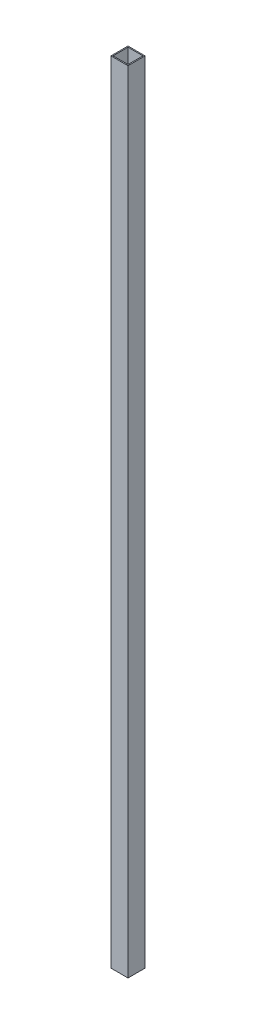
ISO-10303-21;
HEADER;
FILE_DESCRIPTION(('STEP AP214'),'2;1');
FILE_NAME('part.step','',(''),(''),'','','');
FILE_SCHEMA(('AUTOMOTIVE_DESIGN { 1 0 10303 214 1 1 1 1 }'));
ENDSEC;
DATA;
#1=APPLICATION_CONTEXT('core data for automotive mechanical design processes');
#2=APPLICATION_PROTOCOL_DEFINITION('international standard','automotive_design',2000,#1);
#3=PRODUCT_CONTEXT('',#1,'mechanical');
#4=PRODUCT('Part','Part','',(#3));
#5=PRODUCT_RELATED_PRODUCT_CATEGORY('part','',(#4));
#6=PRODUCT_DEFINITION_FORMATION('','',#4);
#7=PRODUCT_DEFINITION_CONTEXT('part definition',#1,'design');
#8=PRODUCT_DEFINITION('design','',#6,#7);
#9=PRODUCT_DEFINITION_SHAPE('','',#8);
#10=(LENGTH_UNIT() NAMED_UNIT(*) SI_UNIT(.MILLI.,.METRE.));
#11=(NAMED_UNIT(*) PLANE_ANGLE_UNIT() SI_UNIT($,.RADIAN.));
#12=(NAMED_UNIT(*) SI_UNIT($,.STERADIAN.) SOLID_ANGLE_UNIT());
#13=UNCERTAINTY_MEASURE_WITH_UNIT(LENGTH_MEASURE(1.E-05),#10,'distance_accuracy_value','');
#14=(GEOMETRIC_REPRESENTATION_CONTEXT(3) GLOBAL_UNCERTAINTY_ASSIGNED_CONTEXT((#13)) GLOBAL_UNIT_ASSIGNED_CONTEXT((#10,
#11,#12)) REPRESENTATION_CONTEXT('',''));
#15=CARTESIAN_POINT('',(0.,0.,0.));
#16=DIRECTION('',(0.,0.,1.));
#17=DIRECTION('',(1.,0.,0.));
#18=AXIS2_PLACEMENT_3D('',#15,#16,#17);
#19=CARTESIAN_POINT('',(0.,370.,0.));
#20=DIRECTION('',(0.,-1.,0.));
#21=DIRECTION('',(0.,0.,-1.));
#22=AXIS2_PLACEMENT_3D('',#19,#20,#21);
#23=PLANE('',#22);
#24=DIRECTION('',(0.,0.,1.));
#25=VECTOR('',#24,1.);
#26=CARTESIAN_POINT('',(0.,370.,0.));
#27=LINE('',#26,#25);
#28=CARTESIAN_POINT('',(0.,370.,-8.));
#29=VERTEX_POINT('',#28);
#30=CARTESIAN_POINT('',(0.,370.,0.));
#31=VERTEX_POINT('',#30);
#32=EDGE_CURVE('E134',#29,#31,#27,.T.);
#33=ORIENTED_EDGE('',*,*,#32,.T.);
#34=DIRECTION('',(1.,0.,0.));
#35=VECTOR('',#34,1.);
#36=CARTESIAN_POINT('',(0.,370.,0.));
#37=LINE('',#36,#35);
#38=CARTESIAN_POINT('',(8.,370.,0.));
#39=VERTEX_POINT('',#38);
#40=EDGE_CURVE('E137',#31,#39,#37,.T.);
#41=ORIENTED_EDGE('',*,*,#40,.T.);
#42=DIRECTION('',(0.,0.,-1.));
#43=VECTOR('',#42,1.);
#44=CARTESIAN_POINT('',(8.,370.,0.));
#45=LINE('',#44,#43);
#46=CARTESIAN_POINT('',(8.,370.,-8.));
#47=VERTEX_POINT('',#46);
#48=EDGE_CURVE('E140',#39,#47,#45,.T.);
#49=ORIENTED_EDGE('',*,*,#48,.T.);
#50=DIRECTION('',(-1.,0.,0.));
#51=VECTOR('',#50,1.);
#52=CARTESIAN_POINT('',(0.,370.,-8.));
#53=LINE('',#52,#51);
#54=EDGE_CURVE('E142',#47,#29,#53,.T.);
#55=ORIENTED_EDGE('',*,*,#54,.T.);
#56=EDGE_LOOP('',(#33,#41,#49,#55));
#57=FACE_BOUND('',#56,.T.);
#58=DIRECTION('',(0.,0.,1.));
#59=VECTOR('',#58,1.);
#60=CARTESIAN_POINT('',(0.5,370.,-0.5));
#61=LINE('',#60,#59);
#62=CARTESIAN_POINT('',(0.5,370.,-7.5));
#63=VERTEX_POINT('',#62);
#64=CARTESIAN_POINT('',(0.5,370.,-0.5));
#65=VERTEX_POINT('',#64);
#66=EDGE_CURVE('E98',#63,#65,#61,.T.);
#67=ORIENTED_EDGE('',*,*,#66,.F.);
#68=DIRECTION('',(-1.,0.,0.));
#69=VECTOR('',#68,1.);
#70=CARTESIAN_POINT('',(0.5,370.,-7.5));
#71=LINE('',#70,#69);
#72=CARTESIAN_POINT('',(7.5,370.,-7.5));
#73=VERTEX_POINT('',#72);
#74=EDGE_CURVE('E120',#73,#63,#71,.T.);
#75=ORIENTED_EDGE('',*,*,#74,.F.);
#76=DIRECTION('',(0.,0.,-1.));
#77=VECTOR('',#76,1.);
#78=CARTESIAN_POINT('',(7.5,370.,-0.5));
#79=LINE('',#78,#77);
#80=CARTESIAN_POINT('',(7.5,370.,-0.5));
#81=VERTEX_POINT('',#80);
#82=EDGE_CURVE('E118',#81,#73,#79,.T.);
#83=ORIENTED_EDGE('',*,*,#82,.F.);
#84=DIRECTION('',(1.,0.,0.));
#85=VECTOR('',#84,1.);
#86=CARTESIAN_POINT('',(0.5,370.,-0.5));
#87=LINE('',#86,#85);
#88=EDGE_CURVE('E106',#65,#81,#87,.T.);
#89=ORIENTED_EDGE('',*,*,#88,.F.);
#90=EDGE_LOOP('',(#67,#75,#83,#89));
#91=FACE_BOUND('',#90,.T.);
#92=ADVANCED_FACE('F33',(#57,#91),#23,.F.);
#93=CARTESIAN_POINT('',(0.,0.,0.));
#94=DIRECTION('',(0.,-1.,0.));
#95=DIRECTION('',(0.,0.,-1.));
#96=AXIS2_PLACEMENT_3D('',#93,#94,#95);
#97=PLANE('',#96);
#98=DIRECTION('',(0.,0.,1.));
#99=VECTOR('',#98,1.);
#100=CARTESIAN_POINT('',(0.,0.,0.));
#101=LINE('',#100,#99);
#102=CARTESIAN_POINT('',(0.,0.,-8.));
#103=VERTEX_POINT('',#102);
#104=CARTESIAN_POINT('',(0.,0.,0.));
#105=VERTEX_POINT('',#104);
#106=EDGE_CURVE('E114',#103,#105,#101,.T.);
#107=ORIENTED_EDGE('',*,*,#106,.F.);
#108=DIRECTION('',(-1.,0.,0.));
#109=VECTOR('',#108,1.);
#110=CARTESIAN_POINT('',(0.,0.,-8.));
#111=LINE('',#110,#109);
#112=CARTESIAN_POINT('',(8.,0.,-8.));
#113=VERTEX_POINT('',#112);
#114=EDGE_CURVE('E138',#113,#103,#111,.T.);
#115=ORIENTED_EDGE('',*,*,#114,.F.);
#116=DIRECTION('',(0.,0.,-1.));
#117=VECTOR('',#116,1.);
#118=CARTESIAN_POINT('',(8.,0.,0.));
#119=LINE('',#118,#117);
#120=CARTESIAN_POINT('',(8.,0.,0.));
#121=VERTEX_POINT('',#120);
#122=EDGE_CURVE('E149',#121,#113,#119,.T.);
#123=ORIENTED_EDGE('',*,*,#122,.F.);
#124=DIRECTION('',(1.,0.,0.));
#125=VECTOR('',#124,1.);
#126=CARTESIAN_POINT('',(0.,0.,0.));
#127=LINE('',#126,#125);
#128=EDGE_CURVE('E147',#105,#121,#127,.T.);
#129=ORIENTED_EDGE('',*,*,#128,.F.);
#130=EDGE_LOOP('',(#107,#115,#123,#129));
#131=FACE_BOUND('',#130,.T.);
#132=DIRECTION('',(-1.,0.,0.));
#133=VECTOR('',#132,1.);
#134=CARTESIAN_POINT('',(0.5,0.,-7.5));
#135=LINE('',#134,#133);
#136=CARTESIAN_POINT('',(7.5,0.,-7.5));
#137=VERTEX_POINT('',#136);
#138=CARTESIAN_POINT('',(0.5,0.,-7.5));
#139=VERTEX_POINT('',#138);
#140=EDGE_CURVE('E107',#137,#139,#135,.T.);
#141=ORIENTED_EDGE('',*,*,#140,.T.);
#142=DIRECTION('',(0.,0.,1.));
#143=VECTOR('',#142,1.);
#144=CARTESIAN_POINT('',(0.5,0.,-0.5));
#145=LINE('',#144,#143);
#146=CARTESIAN_POINT('',(0.5,0.,-0.5));
#147=VERTEX_POINT('',#146);
#148=EDGE_CURVE('E56',#139,#147,#145,.T.);
#149=ORIENTED_EDGE('',*,*,#148,.T.);
#150=DIRECTION('',(1.,0.,0.));
#151=VECTOR('',#150,1.);
#152=CARTESIAN_POINT('',(0.5,0.,-0.5));
#153=LINE('',#152,#151);
#154=CARTESIAN_POINT('',(7.5,0.,-0.5));
#155=VERTEX_POINT('',#154);
#156=EDGE_CURVE('E113',#147,#155,#153,.T.);
#157=ORIENTED_EDGE('',*,*,#156,.T.);
#158=DIRECTION('',(0.,0.,-1.));
#159=VECTOR('',#158,1.);
#160=CARTESIAN_POINT('',(7.5,0.,-0.5));
#161=LINE('',#160,#159);
#162=EDGE_CURVE('E126',#155,#137,#161,.T.);
#163=ORIENTED_EDGE('',*,*,#162,.T.);
#164=EDGE_LOOP('',(#141,#149,#157,#163));
#165=FACE_BOUND('',#164,.T.);
#166=ADVANCED_FACE('F167',(#131,#165),#97,.T.);
#167=CARTESIAN_POINT('',(0.,370.,0.));
#168=DIRECTION('',(1.,0.,0.));
#169=DIRECTION('',(0.,0.,-1.));
#170=AXIS2_PLACEMENT_3D('',#167,#168,#169);
#171=PLANE('',#170);
#172=ORIENTED_EDGE('',*,*,#106,.T.);
#173=DIRECTION('',(0.,-1.,0.));
#174=VECTOR('',#173,1.);
#175=CARTESIAN_POINT('',(0.,370.,0.));
#176=LINE('',#175,#174);
#177=EDGE_CURVE('E11',#31,#105,#176,.T.);
#178=ORIENTED_EDGE('',*,*,#177,.F.);
#179=ORIENTED_EDGE('',*,*,#32,.F.);
#180=DIRECTION('',(0.,-1.,0.));
#181=VECTOR('',#180,1.);
#182=CARTESIAN_POINT('',(0.,370.,-8.));
#183=LINE('',#182,#181);
#184=EDGE_CURVE('E144',#29,#103,#183,.T.);
#185=ORIENTED_EDGE('',*,*,#184,.T.);
#186=EDGE_LOOP('',(#172,#178,#179,#185));
#187=FACE_BOUND('',#186,.T.);
#188=ADVANCED_FACE('F35',(#187),#171,.F.);
#189=CARTESIAN_POINT('',(0.,370.,0.));
#190=DIRECTION('',(0.,0.,-1.));
#191=DIRECTION('',(-1.,0.,0.));
#192=AXIS2_PLACEMENT_3D('',#189,#190,#191);
#193=PLANE('',#192);
#194=ORIENTED_EDGE('',*,*,#128,.T.);
#195=DIRECTION('',(0.,-1.,0.));
#196=VECTOR('',#195,1.);
#197=CARTESIAN_POINT('',(8.,370.,0.));
#198=LINE('',#197,#196);
#199=EDGE_CURVE('E41',#39,#121,#198,.T.);
#200=ORIENTED_EDGE('',*,*,#199,.F.);
#201=ORIENTED_EDGE('',*,*,#40,.F.);
#202=ORIENTED_EDGE('',*,*,#177,.T.);
#203=EDGE_LOOP('',(#194,#200,#201,#202));
#204=FACE_BOUND('',#203,.T.);
#205=ADVANCED_FACE('F177',(#204),#193,.F.);
#206=CARTESIAN_POINT('',(8.,370.,0.));
#207=DIRECTION('',(-1.,0.,0.));
#208=DIRECTION('',(0.,0.,1.));
#209=AXIS2_PLACEMENT_3D('',#206,#207,#208);
#210=PLANE('',#209);
#211=ORIENTED_EDGE('',*,*,#122,.T.);
#212=DIRECTION('',(0.,-1.,0.));
#213=VECTOR('',#212,1.);
#214=CARTESIAN_POINT('',(8.,370.,-8.));
#215=LINE('',#214,#213);
#216=EDGE_CURVE('E154',#47,#113,#215,.T.);
#217=ORIENTED_EDGE('',*,*,#216,.F.);
#218=ORIENTED_EDGE('',*,*,#48,.F.);
#219=ORIENTED_EDGE('',*,*,#199,.T.);
#220=EDGE_LOOP('',(#211,#217,#218,#219));
#221=FACE_BOUND('',#220,.T.);
#222=ADVANCED_FACE('F161',(#221),#210,.F.);
#223=CARTESIAN_POINT('',(0.,370.,-8.));
#224=DIRECTION('',(0.,0.,1.));
#225=DIRECTION('',(1.,0.,0.));
#226=AXIS2_PLACEMENT_3D('',#223,#224,#225);
#227=PLANE('',#226);
#228=ORIENTED_EDGE('',*,*,#114,.T.);
#229=ORIENTED_EDGE('',*,*,#184,.F.);
#230=ORIENTED_EDGE('',*,*,#54,.F.);
#231=ORIENTED_EDGE('',*,*,#216,.T.);
#232=EDGE_LOOP('',(#228,#229,#230,#231));
#233=FACE_BOUND('',#232,.T.);
#234=ADVANCED_FACE('F171',(#233),#227,.F.);
#235=CARTESIAN_POINT('',(0.5,370.,-0.5));
#236=DIRECTION('',(1.,0.,0.));
#237=DIRECTION('',(0.,0.,-1.));
#238=AXIS2_PLACEMENT_3D('',#235,#236,#237);
#239=PLANE('',#238);
#240=ORIENTED_EDGE('',*,*,#148,.F.);
#241=DIRECTION('',(0.,-1.,0.));
#242=VECTOR('',#241,1.);
#243=CARTESIAN_POINT('',(0.5,370.,-7.5));
#244=LINE('',#243,#242);
#245=EDGE_CURVE('E102',#63,#139,#244,.T.);
#246=ORIENTED_EDGE('',*,*,#245,.F.);
#247=ORIENTED_EDGE('',*,*,#66,.T.);
#248=DIRECTION('',(0.,-1.,0.));
#249=VECTOR('',#248,1.);
#250=CARTESIAN_POINT('',(0.5,370.,-0.5));
#251=LINE('',#250,#249);
#252=EDGE_CURVE('E101',#65,#147,#251,.T.);
#253=ORIENTED_EDGE('',*,*,#252,.T.);
#254=EDGE_LOOP('',(#240,#246,#247,#253));
#255=FACE_BOUND('',#254,.T.);
#256=ADVANCED_FACE('F100',(#255),#239,.T.);
#257=CARTESIAN_POINT('',(0.5,370.,-0.5));
#258=DIRECTION('',(0.,0.,-1.));
#259=DIRECTION('',(-1.,0.,0.));
#260=AXIS2_PLACEMENT_3D('',#257,#258,#259);
#261=PLANE('',#260);
#262=ORIENTED_EDGE('',*,*,#156,.F.);
#263=ORIENTED_EDGE('',*,*,#252,.F.);
#264=ORIENTED_EDGE('',*,*,#88,.T.);
#265=DIRECTION('',(0.,-1.,0.));
#266=VECTOR('',#265,1.);
#267=CARTESIAN_POINT('',(7.5,370.,-0.5));
#268=LINE('',#267,#266);
#269=EDGE_CURVE('E115',#81,#155,#268,.T.);
#270=ORIENTED_EDGE('',*,*,#269,.T.);
#271=EDGE_LOOP('',(#262,#263,#264,#270));
#272=FACE_BOUND('',#271,.T.);
#273=ADVANCED_FACE('F110',(#272),#261,.T.);
#274=CARTESIAN_POINT('',(7.5,370.,-0.5));
#275=DIRECTION('',(-1.,0.,0.));
#276=DIRECTION('',(0.,0.,1.));
#277=AXIS2_PLACEMENT_3D('',#274,#275,#276);
#278=PLANE('',#277);
#279=ORIENTED_EDGE('',*,*,#162,.F.);
#280=ORIENTED_EDGE('',*,*,#269,.F.);
#281=ORIENTED_EDGE('',*,*,#82,.T.);
#282=DIRECTION('',(0.,-1.,0.));
#283=VECTOR('',#282,1.);
#284=CARTESIAN_POINT('',(7.5,370.,-7.5));
#285=LINE('',#284,#283);
#286=EDGE_CURVE('E48',#73,#137,#285,.T.);
#287=ORIENTED_EDGE('',*,*,#286,.T.);
#288=EDGE_LOOP('',(#279,#280,#281,#287));
#289=FACE_BOUND('',#288,.T.);
#290=ADVANCED_FACE('F200',(#289),#278,.T.);
#291=CARTESIAN_POINT('',(0.5,370.,-7.5));
#292=DIRECTION('',(0.,0.,1.));
#293=DIRECTION('',(1.,0.,0.));
#294=AXIS2_PLACEMENT_3D('',#291,#292,#293);
#295=PLANE('',#294);
#296=ORIENTED_EDGE('',*,*,#140,.F.);
#297=ORIENTED_EDGE('',*,*,#286,.F.);
#298=ORIENTED_EDGE('',*,*,#74,.T.);
#299=ORIENTED_EDGE('',*,*,#245,.T.);
#300=EDGE_LOOP('',(#296,#297,#298,#299));
#301=FACE_BOUND('',#300,.T.);
#302=ADVANCED_FACE('F204',(#301),#295,.T.);
#303=CLOSED_SHELL('',(#92,#166,#188,#205,#222,#234,#256,#273,#290,#302));
#304=MANIFOLD_SOLID_BREP('B2',#303);
#305=ADVANCED_BREP_SHAPE_REPRESENTATION('',(#18,#304),#14);
#306=SHAPE_DEFINITION_REPRESENTATION(#9,#305);
ENDSEC;
END-ISO-10303-21;
